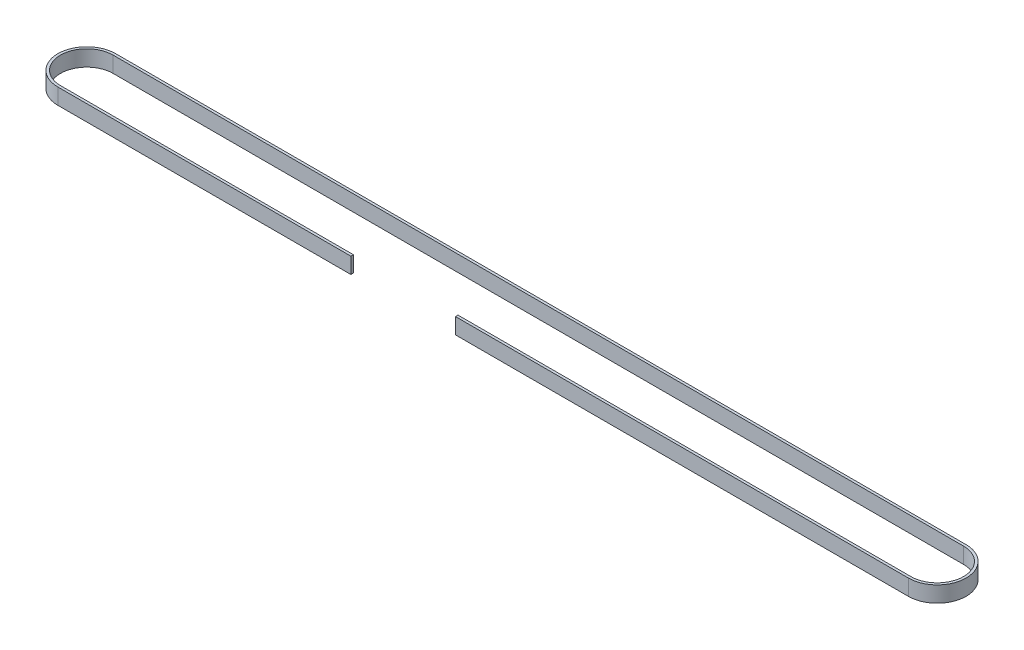
ISO-10303-21;
HEADER;
FILE_DESCRIPTION(('STEP AP214'),'2;1');
FILE_NAME('part.step','',(''),(''),'','','');
FILE_SCHEMA(('AUTOMOTIVE_DESIGN { 1 0 10303 214 1 1 1 1 }'));
ENDSEC;
DATA;
#1=APPLICATION_CONTEXT('core data for automotive mechanical design processes');
#2=APPLICATION_PROTOCOL_DEFINITION('international standard','automotive_design',2000,#1);
#3=PRODUCT_CONTEXT('',#1,'mechanical');
#4=PRODUCT('Part','Part','',(#3));
#5=PRODUCT_RELATED_PRODUCT_CATEGORY('part','',(#4));
#6=PRODUCT_DEFINITION_FORMATION('','',#4);
#7=PRODUCT_DEFINITION_CONTEXT('part definition',#1,'design');
#8=PRODUCT_DEFINITION('design','',#6,#7);
#9=PRODUCT_DEFINITION_SHAPE('','',#8);
#10=(LENGTH_UNIT() NAMED_UNIT(*) SI_UNIT(.MILLI.,.METRE.));
#11=(NAMED_UNIT(*) PLANE_ANGLE_UNIT() SI_UNIT($,.RADIAN.));
#12=(NAMED_UNIT(*) SI_UNIT($,.STERADIAN.) SOLID_ANGLE_UNIT());
#13=UNCERTAINTY_MEASURE_WITH_UNIT(LENGTH_MEASURE(1.E-05),#10,'distance_accuracy_value','');
#14=(GEOMETRIC_REPRESENTATION_CONTEXT(3) GLOBAL_UNCERTAINTY_ASSIGNED_CONTEXT((#13)) GLOBAL_UNIT_ASSIGNED_CONTEXT((#10,
#11,#12)) REPRESENTATION_CONTEXT('',''));
#15=CARTESIAN_POINT('',(0.,0.,0.));
#16=DIRECTION('',(0.,0.,1.));
#17=DIRECTION('',(1.,0.,0.));
#18=AXIS2_PLACEMENT_3D('',#15,#16,#17);
#19=CARTESIAN_POINT('',(0.,9.652,17.272));
#20=DIRECTION('',(0.,0.,-1.));
#21=DIRECTION('',(-1.,0.,0.));
#22=AXIS2_PLACEMENT_3D('',#19,#20,#21);
#23=PLANE('',#22);
#24=DIRECTION('',(1.,0.,0.));
#25=VECTOR('',#24,1.);
#26=CARTESIAN_POINT('',(0.,0.,17.272));
#27=LINE('',#26,#25);
#28=CARTESIAN_POINT('',(0.,0.,17.272));
#29=VERTEX_POINT('',#28);
#30=CARTESIAN_POINT('',(177.8,0.,17.272));
#31=VERTEX_POINT('',#30);
#32=EDGE_CURVE('E149',#29,#31,#27,.T.);
#33=ORIENTED_EDGE('',*,*,#32,.T.);
#34=DIRECTION('',(0.,-1.,0.));
#35=VECTOR('',#34,1.);
#36=CARTESIAN_POINT('',(177.8,9.652,17.272));
#37=LINE('',#36,#35);
#38=CARTESIAN_POINT('',(177.8,9.652,17.272));
#39=VERTEX_POINT('',#38);
#40=EDGE_CURVE('E136',#39,#31,#37,.T.);
#41=ORIENTED_EDGE('',*,*,#40,.F.);
#42=DIRECTION('',(1.,0.,0.));
#43=VECTOR('',#42,1.);
#44=CARTESIAN_POINT('',(0.,9.652,17.272));
#45=LINE('',#44,#43);
#46=CARTESIAN_POINT('',(0.,9.652,17.272));
#47=VERTEX_POINT('',#46);
#48=EDGE_CURVE('E232',#47,#39,#45,.T.);
#49=ORIENTED_EDGE('',*,*,#48,.F.);
#50=DIRECTION('',(0.,-1.,0.));
#51=VECTOR('',#50,1.);
#52=CARTESIAN_POINT('',(0.,9.652,17.272));
#53=LINE('',#52,#51);
#54=EDGE_CURVE('E156',#47,#29,#53,.T.);
#55=ORIENTED_EDGE('',*,*,#54,.T.);
#56=EDGE_LOOP('',(#33,#41,#49,#55));
#57=FACE_BOUND('',#56,.T.);
#58=ADVANCED_FACE('F42',(#57),#23,.F.);
#59=CARTESIAN_POINT('',(0.,9.652,15.748));
#60=DIRECTION('',(0.,0.,-1.));
#61=DIRECTION('',(-1.,0.,0.));
#62=AXIS2_PLACEMENT_3D('',#59,#60,#61);
#63=PLANE('',#62);
#64=DIRECTION('',(0.,1.,0.));
#65=VECTOR('',#64,1.);
#66=CARTESIAN_POINT('',(177.8,9.652,15.748));
#67=LINE('',#66,#65);
#68=CARTESIAN_POINT('',(177.8,0.,15.748));
#69=VERTEX_POINT('',#68);
#70=CARTESIAN_POINT('',(177.8,9.652,15.748));
#71=VERTEX_POINT('',#70);
#72=EDGE_CURVE('E11',#69,#71,#67,.T.);
#73=ORIENTED_EDGE('',*,*,#72,.F.);
#74=DIRECTION('',(1.,0.,0.));
#75=VECTOR('',#74,1.);
#76=CARTESIAN_POINT('',(0.,0.,15.748));
#77=LINE('',#76,#75);
#78=CARTESIAN_POINT('',(0.,0.,15.748));
#79=VERTEX_POINT('',#78);
#80=EDGE_CURVE('E152',#79,#69,#77,.T.);
#81=ORIENTED_EDGE('',*,*,#80,.F.);
#82=DIRECTION('',(0.,-1.,0.));
#83=VECTOR('',#82,1.);
#84=CARTESIAN_POINT('',(0.,9.652,15.748));
#85=LINE('',#84,#83);
#86=CARTESIAN_POINT('',(0.,9.652,15.748));
#87=VERTEX_POINT('',#86);
#88=EDGE_CURVE('E224',#87,#79,#85,.T.);
#89=ORIENTED_EDGE('',*,*,#88,.F.);
#90=DIRECTION('',(1.,0.,0.));
#91=VECTOR('',#90,1.);
#92=CARTESIAN_POINT('',(0.,9.652,15.748));
#93=LINE('',#92,#91);
#94=EDGE_CURVE('E257',#87,#71,#93,.T.);
#95=ORIENTED_EDGE('',*,*,#94,.T.);
#96=EDGE_LOOP('',(#73,#81,#89,#95));
#97=FACE_BOUND('',#96,.T.);
#98=ADVANCED_FACE('F272',(#97),#63,.T.);
#99=CARTESIAN_POINT('',(0.,9.652,-0.254000000000001));
#100=DIRECTION('',(0.,1.,0.));
#101=DIRECTION('',(0.,0.,1.));
#102=AXIS2_PLACEMENT_3D('',#99,#100,#101);
#103=PLANE('',#102);
#104=DIRECTION('',(0.,0.,1.));
#105=VECTOR('',#104,1.);
#106=CARTESIAN_POINT('',(177.8,9.652,4.572));
#107=LINE('',#106,#105);
#108=EDGE_CURVE('E139',#71,#39,#107,.T.);
#109=ORIENTED_EDGE('',*,*,#108,.F.);
#110=ORIENTED_EDGE('',*,*,#94,.F.);
#111=CARTESIAN_POINT('',(0.,9.652,-0.254000000000001));
#112=DIRECTION('',(0.,1.,0.));
#113=DIRECTION('',(0.,0.,1.));
#114=AXIS2_PLACEMENT_3D('',#111,#112,#113);
#115=CIRCLE('',#114,16.002);
#116=CARTESIAN_POINT('',(0.,9.652,-16.256));
#117=VERTEX_POINT('',#116);
#118=EDGE_CURVE('E215',#117,#87,#115,.T.);
#119=ORIENTED_EDGE('',*,*,#118,.F.);
#120=DIRECTION('',(-1.,0.,0.));
#121=VECTOR('',#120,1.);
#122=CARTESIAN_POINT('',(0.,9.652,-16.256));
#123=LINE('',#122,#121);
#124=CARTESIAN_POINT('',(516.128,9.652,-16.256));
#125=VERTEX_POINT('',#124);
#126=EDGE_CURVE('E221',#125,#117,#123,.T.);
#127=ORIENTED_EDGE('',*,*,#126,.F.);
#128=CARTESIAN_POINT('',(516.128,9.652,-0.254000000000001));
#129=DIRECTION('',(0.,1.,0.));
#130=DIRECTION('',(0.,0.,1.));
#131=AXIS2_PLACEMENT_3D('',#128,#129,#130);
#132=CIRCLE('',#131,16.002);
#133=CARTESIAN_POINT('',(516.128,9.652,15.748));
#134=VERTEX_POINT('',#133);
#135=EDGE_CURVE('E262',#134,#125,#132,.T.);
#136=ORIENTED_EDGE('',*,*,#135,.F.);
#137=CARTESIAN_POINT('',(241.3,9.652,15.748));
#138=VERTEX_POINT('',#137);
#139=EDGE_CURVE('E250',#138,#134,#93,.T.);
#140=ORIENTED_EDGE('',*,*,#139,.F.);
#141=DIRECTION('',(0.,0.,1.));
#142=VECTOR('',#141,1.);
#143=CARTESIAN_POINT('',(241.3,9.65200000000004,4.572));
#144=LINE('',#143,#142);
#145=CARTESIAN_POINT('',(241.3,9.65200000000004,17.272));
#146=VERTEX_POINT('',#145);
#147=EDGE_CURVE('E57',#138,#146,#144,.T.);
#148=ORIENTED_EDGE('',*,*,#147,.T.);
#149=CARTESIAN_POINT('',(516.128,9.652,17.272));
#150=VERTEX_POINT('',#149);
#151=EDGE_CURVE('E231',#146,#150,#45,.T.);
#152=ORIENTED_EDGE('',*,*,#151,.T.);
#153=CARTESIAN_POINT('',(516.128,9.652,-0.254000000000001));
#154=DIRECTION('',(0.,1.,0.));
#155=DIRECTION('',(0.,0.,1.));
#156=AXIS2_PLACEMENT_3D('',#153,#154,#155);
#157=CIRCLE('',#156,17.526);
#158=CARTESIAN_POINT('',(516.128,9.652,-17.78));
#159=VERTEX_POINT('',#158);
#160=EDGE_CURVE('E235',#150,#159,#157,.T.);
#161=ORIENTED_EDGE('',*,*,#160,.T.);
#162=DIRECTION('',(-1.,0.,0.));
#163=VECTOR('',#162,1.);
#164=CARTESIAN_POINT('',(0.,9.652,-17.78));
#165=LINE('',#164,#163);
#166=CARTESIAN_POINT('',(0.,9.652,-17.78));
#167=VERTEX_POINT('',#166);
#168=EDGE_CURVE('E179',#159,#167,#165,.T.);
#169=ORIENTED_EDGE('',*,*,#168,.T.);
#170=CARTESIAN_POINT('',(0.,9.652,-0.254000000000001));
#171=DIRECTION('',(0.,1.,0.));
#172=DIRECTION('',(0.,0.,1.));
#173=AXIS2_PLACEMENT_3D('',#170,#171,#172);
#174=CIRCLE('',#173,17.526);
#175=EDGE_CURVE('E173',#167,#47,#174,.T.);
#176=ORIENTED_EDGE('',*,*,#175,.T.);
#177=ORIENTED_EDGE('',*,*,#48,.T.);
#178=EDGE_LOOP('',(#109,#110,#119,#127,#136,#140,#148,#152,#161,#169,#176,#177));
#179=FACE_BOUND('',#178,.T.);
#180=ADVANCED_FACE('F240',(#179),#103,.T.);
#181=CARTESIAN_POINT('',(0.,0.,-0.254000000000001));
#182=DIRECTION('',(0.,1.,0.));
#183=DIRECTION('',(0.,0.,1.));
#184=AXIS2_PLACEMENT_3D('',#181,#182,#183);
#185=PLANE('',#184);
#186=ORIENTED_EDGE('',*,*,#80,.T.);
#187=DIRECTION('',(0.,0.,1.));
#188=VECTOR('',#187,1.);
#189=CARTESIAN_POINT('',(177.8,0.,4.572));
#190=LINE('',#189,#188);
#191=EDGE_CURVE('E64',#69,#31,#190,.T.);
#192=ORIENTED_EDGE('',*,*,#191,.T.);
#193=ORIENTED_EDGE('',*,*,#32,.F.);
#194=CARTESIAN_POINT('',(0.,0.,-0.254000000000001));
#195=DIRECTION('',(0.,1.,0.));
#196=DIRECTION('',(0.,0.,1.));
#197=AXIS2_PLACEMENT_3D('',#194,#195,#196);
#198=CIRCLE('',#197,17.526);
#199=CARTESIAN_POINT('',(0.,0.,-17.78));
#200=VERTEX_POINT('',#199);
#201=EDGE_CURVE('E167',#200,#29,#198,.T.);
#202=ORIENTED_EDGE('',*,*,#201,.F.);
#203=DIRECTION('',(-1.,0.,0.));
#204=VECTOR('',#203,1.);
#205=CARTESIAN_POINT('',(0.,0.,-17.78));
#206=LINE('',#205,#204);
#207=CARTESIAN_POINT('',(516.128,0.,-17.78));
#208=VERTEX_POINT('',#207);
#209=EDGE_CURVE('E164',#208,#200,#206,.T.);
#210=ORIENTED_EDGE('',*,*,#209,.F.);
#211=CARTESIAN_POINT('',(516.128,0.,-0.254000000000001));
#212=DIRECTION('',(0.,1.,0.));
#213=DIRECTION('',(0.,0.,1.));
#214=AXIS2_PLACEMENT_3D('',#211,#212,#213);
#215=CIRCLE('',#214,17.526);
#216=CARTESIAN_POINT('',(516.128,0.,17.272));
#217=VERTEX_POINT('',#216);
#218=EDGE_CURVE('E159',#217,#208,#215,.T.);
#219=ORIENTED_EDGE('',*,*,#218,.F.);
#220=CARTESIAN_POINT('',(241.3,0.,17.272));
#221=VERTEX_POINT('',#220);
#222=EDGE_CURVE('E160',#221,#217,#27,.T.);
#223=ORIENTED_EDGE('',*,*,#222,.F.);
#224=DIRECTION('',(0.,0.,1.));
#225=VECTOR('',#224,1.);
#226=CARTESIAN_POINT('',(241.3,0.,4.572));
#227=LINE('',#226,#225);
#228=CARTESIAN_POINT('',(241.3,0.,15.748));
#229=VERTEX_POINT('',#228);
#230=EDGE_CURVE('E153',#229,#221,#227,.T.);
#231=ORIENTED_EDGE('',*,*,#230,.F.);
#232=CARTESIAN_POINT('',(516.128,0.,15.748));
#233=VERTEX_POINT('',#232);
#234=EDGE_CURVE('E194',#229,#233,#77,.T.);
#235=ORIENTED_EDGE('',*,*,#234,.T.);
#236=CARTESIAN_POINT('',(516.128,0.,-0.254000000000001));
#237=DIRECTION('',(0.,1.,0.));
#238=DIRECTION('',(0.,0.,1.));
#239=AXIS2_PLACEMENT_3D('',#236,#237,#238);
#240=CIRCLE('',#239,16.002);
#241=CARTESIAN_POINT('',(516.128,0.,-16.256));
#242=VERTEX_POINT('',#241);
#243=EDGE_CURVE('E206',#233,#242,#240,.T.);
#244=ORIENTED_EDGE('',*,*,#243,.T.);
#245=DIRECTION('',(-1.,0.,0.));
#246=VECTOR('',#245,1.);
#247=CARTESIAN_POINT('',(0.,0.,-16.256));
#248=LINE('',#247,#246);
#249=CARTESIAN_POINT('',(0.,0.,-16.256));
#250=VERTEX_POINT('',#249);
#251=EDGE_CURVE('E211',#242,#250,#248,.T.);
#252=ORIENTED_EDGE('',*,*,#251,.T.);
#253=CARTESIAN_POINT('',(0.,0.,-0.254000000000001));
#254=DIRECTION('',(0.,1.,0.));
#255=DIRECTION('',(0.,0.,1.));
#256=AXIS2_PLACEMENT_3D('',#253,#254,#255);
#257=CIRCLE('',#256,16.002);
#258=EDGE_CURVE('E203',#250,#79,#257,.T.);
#259=ORIENTED_EDGE('',*,*,#258,.T.);
#260=EDGE_LOOP('',(#186,#192,#193,#202,#210,#219,#223,#231,#235,#244,#252,#259));
#261=FACE_BOUND('',#260,.T.);
#262=ADVANCED_FACE('F147',(#261),#185,.F.);
#263=CARTESIAN_POINT('',(0.,9.652,-0.254000000000001));
#264=DIRECTION('',(0.,-1.,0.));
#265=DIRECTION('',(0.,0.,-1.));
#266=AXIS2_PLACEMENT_3D('',#263,#264,#265);
#267=CYLINDRICAL_SURFACE('',#266,17.526);
#268=ORIENTED_EDGE('',*,*,#201,.T.);
#269=ORIENTED_EDGE('',*,*,#54,.F.);
#270=ORIENTED_EDGE('',*,*,#175,.F.);
#271=DIRECTION('',(0.,-1.,0.));
#272=VECTOR('',#271,1.);
#273=CARTESIAN_POINT('',(0.,9.652,-17.78));
#274=LINE('',#273,#272);
#275=EDGE_CURVE('E174',#167,#200,#274,.T.);
#276=ORIENTED_EDGE('',*,*,#275,.T.);
#277=EDGE_LOOP('',(#268,#269,#270,#276));
#278=FACE_BOUND('',#277,.T.);
#279=ADVANCED_FACE('F44',(#278),#267,.T.);
#280=ORIENTED_EDGE('',*,*,#151,.F.);
#281=DIRECTION('',(0.,1.,0.));
#282=VECTOR('',#281,1.);
#283=CARTESIAN_POINT('',(241.3,9.65200000000004,17.272));
#284=LINE('',#283,#282);
#285=EDGE_CURVE('E143',#221,#146,#284,.T.);
#286=ORIENTED_EDGE('',*,*,#285,.F.);
#287=ORIENTED_EDGE('',*,*,#222,.T.);
#288=DIRECTION('',(0.,-1.,0.));
#289=VECTOR('',#288,1.);
#290=CARTESIAN_POINT('',(516.128,9.652,17.272));
#291=LINE('',#290,#289);
#292=EDGE_CURVE('E182',#150,#217,#291,.T.);
#293=ORIENTED_EDGE('',*,*,#292,.F.);
#294=EDGE_LOOP('',(#280,#286,#287,#293));
#295=FACE_BOUND('',#294,.T.);
#296=ADVANCED_FACE('F279',(#295),#23,.F.);
#297=CARTESIAN_POINT('',(516.128,9.652,-0.254000000000001));
#298=DIRECTION('',(0.,-1.,0.));
#299=DIRECTION('',(0.,0.,-1.));
#300=AXIS2_PLACEMENT_3D('',#297,#298,#299);
#301=CYLINDRICAL_SURFACE('',#300,17.526);
#302=ORIENTED_EDGE('',*,*,#218,.T.);
#303=DIRECTION('',(0.,-1.,0.));
#304=VECTOR('',#303,1.);
#305=CARTESIAN_POINT('',(516.128,9.652,-17.78));
#306=LINE('',#305,#304);
#307=EDGE_CURVE('E178',#159,#208,#306,.T.);
#308=ORIENTED_EDGE('',*,*,#307,.F.);
#309=ORIENTED_EDGE('',*,*,#160,.F.);
#310=ORIENTED_EDGE('',*,*,#292,.T.);
#311=EDGE_LOOP('',(#302,#308,#309,#310));
#312=FACE_BOUND('',#311,.T.);
#313=ADVANCED_FACE('F282',(#312),#301,.T.);
#314=CARTESIAN_POINT('',(0.,9.652,-17.78));
#315=DIRECTION('',(0.,0.,1.));
#316=DIRECTION('',(1.,0.,0.));
#317=AXIS2_PLACEMENT_3D('',#314,#315,#316);
#318=PLANE('',#317);
#319=ORIENTED_EDGE('',*,*,#209,.T.);
#320=ORIENTED_EDGE('',*,*,#275,.F.);
#321=ORIENTED_EDGE('',*,*,#168,.F.);
#322=ORIENTED_EDGE('',*,*,#307,.T.);
#323=EDGE_LOOP('',(#319,#320,#321,#322));
#324=FACE_BOUND('',#323,.T.);
#325=ADVANCED_FACE('F245',(#324),#318,.F.);
#326=CARTESIAN_POINT('',(0.,9.652,-0.254000000000001));
#327=DIRECTION('',(0.,-1.,0.));
#328=DIRECTION('',(0.,0.,-1.));
#329=AXIS2_PLACEMENT_3D('',#326,#327,#328);
#330=CYLINDRICAL_SURFACE('',#329,16.002);
#331=ORIENTED_EDGE('',*,*,#258,.F.);
#332=DIRECTION('',(0.,-1.,0.));
#333=VECTOR('',#332,1.);
#334=CARTESIAN_POINT('',(0.,9.652,-16.256));
#335=LINE('',#334,#333);
#336=EDGE_CURVE('E216',#117,#250,#335,.T.);
#337=ORIENTED_EDGE('',*,*,#336,.F.);
#338=ORIENTED_EDGE('',*,*,#118,.T.);
#339=ORIENTED_EDGE('',*,*,#88,.T.);
#340=EDGE_LOOP('',(#331,#337,#338,#339));
#341=FACE_BOUND('',#340,.T.);
#342=ADVANCED_FACE('F269',(#341),#330,.F.);
#343=DIRECTION('',(0.,-1.,0.));
#344=VECTOR('',#343,1.);
#345=CARTESIAN_POINT('',(241.3,9.652,15.748));
#346=LINE('',#345,#344);
#347=EDGE_CURVE('E50',#138,#229,#346,.T.);
#348=ORIENTED_EDGE('',*,*,#347,.F.);
#349=ORIENTED_EDGE('',*,*,#139,.T.);
#350=DIRECTION('',(0.,-1.,0.));
#351=VECTOR('',#350,1.);
#352=CARTESIAN_POINT('',(516.128,9.652,15.748));
#353=LINE('',#352,#351);
#354=EDGE_CURVE('E200',#134,#233,#353,.T.);
#355=ORIENTED_EDGE('',*,*,#354,.T.);
#356=ORIENTED_EDGE('',*,*,#234,.F.);
#357=EDGE_LOOP('',(#348,#349,#355,#356));
#358=FACE_BOUND('',#357,.T.);
#359=ADVANCED_FACE('F198',(#358),#63,.T.);
#360=CARTESIAN_POINT('',(516.128,9.652,-0.254000000000001));
#361=DIRECTION('',(0.,-1.,0.));
#362=DIRECTION('',(0.,0.,-1.));
#363=AXIS2_PLACEMENT_3D('',#360,#361,#362);
#364=CYLINDRICAL_SURFACE('',#363,16.002);
#365=ORIENTED_EDGE('',*,*,#243,.F.);
#366=ORIENTED_EDGE('',*,*,#354,.F.);
#367=ORIENTED_EDGE('',*,*,#135,.T.);
#368=DIRECTION('',(0.,-1.,0.));
#369=VECTOR('',#368,1.);
#370=CARTESIAN_POINT('',(516.128,9.652,-16.256));
#371=LINE('',#370,#369);
#372=EDGE_CURVE('E220',#125,#242,#371,.T.);
#373=ORIENTED_EDGE('',*,*,#372,.T.);
#374=EDGE_LOOP('',(#365,#366,#367,#373));
#375=FACE_BOUND('',#374,.T.);
#376=ADVANCED_FACE('F274',(#375),#364,.F.);
#377=CARTESIAN_POINT('',(0.,9.652,-16.256));
#378=DIRECTION('',(0.,0.,1.));
#379=DIRECTION('',(1.,0.,0.));
#380=AXIS2_PLACEMENT_3D('',#377,#378,#379);
#381=PLANE('',#380);
#382=ORIENTED_EDGE('',*,*,#251,.F.);
#383=ORIENTED_EDGE('',*,*,#372,.F.);
#384=ORIENTED_EDGE('',*,*,#126,.T.);
#385=ORIENTED_EDGE('',*,*,#336,.T.);
#386=EDGE_LOOP('',(#382,#383,#384,#385));
#387=FACE_BOUND('',#386,.T.);
#388=ADVANCED_FACE('F267',(#387),#381,.T.);
#389=CARTESIAN_POINT('',(241.3,9.65200000000004,4.572));
#390=DIRECTION('',(1.,0.,0.));
#391=DIRECTION('',(0.,0.,-1.));
#392=AXIS2_PLACEMENT_3D('',#389,#390,#391);
#393=PLANE('',#392);
#394=ORIENTED_EDGE('',*,*,#347,.T.);
#395=ORIENTED_EDGE('',*,*,#230,.T.);
#396=ORIENTED_EDGE('',*,*,#285,.T.);
#397=ORIENTED_EDGE('',*,*,#147,.F.);
#398=EDGE_LOOP('',(#394,#395,#396,#397));
#399=FACE_BOUND('',#398,.T.);
#400=ADVANCED_FACE('F187',(#399),#393,.F.);
#401=CARTESIAN_POINT('',(177.8,9.652,4.572));
#402=DIRECTION('',(-1.,0.,0.));
#403=DIRECTION('',(0.,0.,1.));
#404=AXIS2_PLACEMENT_3D('',#401,#402,#403);
#405=PLANE('',#404);
#406=ORIENTED_EDGE('',*,*,#72,.T.);
#407=ORIENTED_EDGE('',*,*,#108,.T.);
#408=ORIENTED_EDGE('',*,*,#40,.T.);
#409=ORIENTED_EDGE('',*,*,#191,.F.);
#410=EDGE_LOOP('',(#406,#407,#408,#409));
#411=FACE_BOUND('',#410,.T.);
#412=ADVANCED_FACE('F137',(#411),#405,.F.);
#413=CLOSED_SHELL('',(#58,#98,#180,#262,#279,#296,#313,#325,#342,#359,#376,#388,#400,#412));
#414=MANIFOLD_SOLID_BREP('B2',#413);
#415=ADVANCED_BREP_SHAPE_REPRESENTATION('',(#18,#414),#14);
#416=SHAPE_DEFINITION_REPRESENTATION(#9,#415);
ENDSEC;
END-ISO-10303-21;
